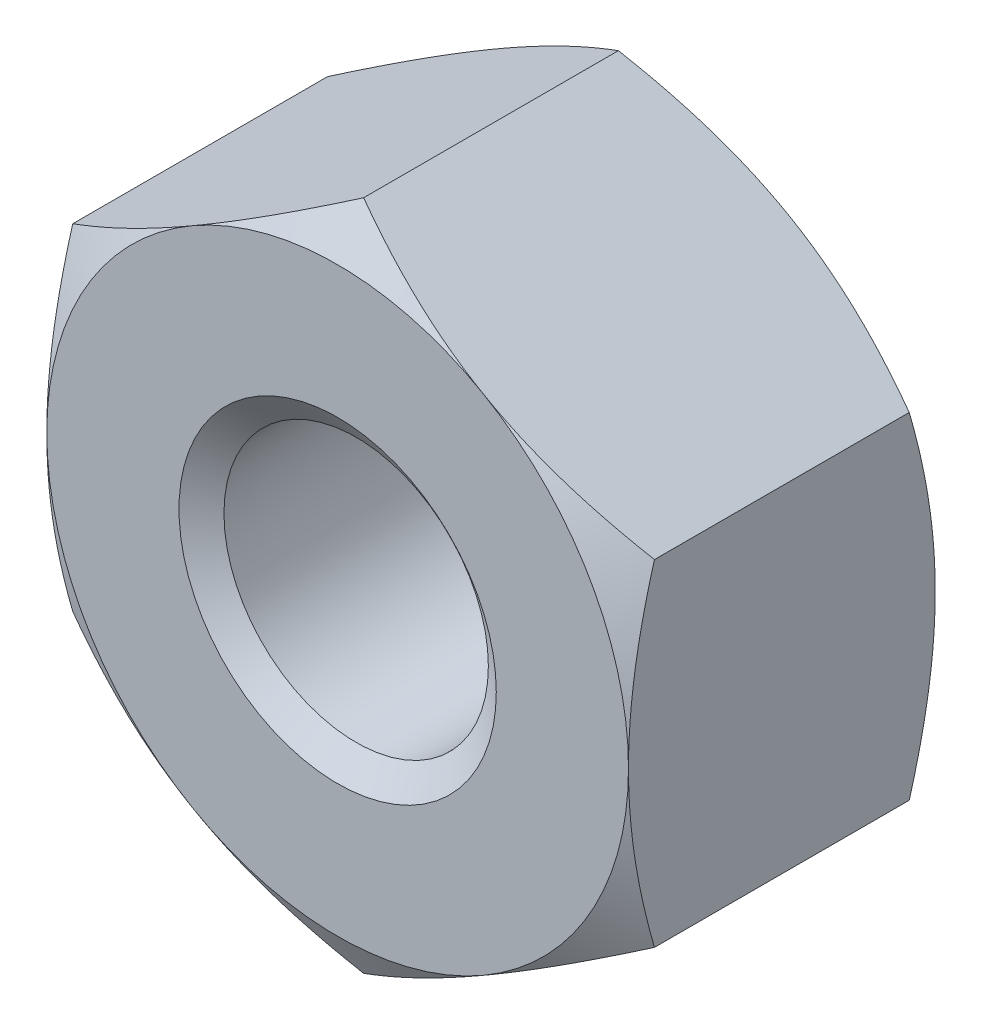
ISO-10303-21;
HEADER;
FILE_DESCRIPTION(('STEP AP214'),'2;1');
FILE_NAME('part.step','',(''),(''),'','','');
FILE_SCHEMA(('AUTOMOTIVE_DESIGN { 1 0 10303 214 1 1 1 1 }'));
ENDSEC;
DATA;
#1=APPLICATION_CONTEXT('core data for automotive mechanical design processes');
#2=APPLICATION_PROTOCOL_DEFINITION('international standard','automotive_design',2000,#1);
#3=PRODUCT_CONTEXT('',#1,'mechanical');
#4=PRODUCT('Part','Part','',(#3));
#5=PRODUCT_RELATED_PRODUCT_CATEGORY('part','',(#4));
#6=PRODUCT_DEFINITION_FORMATION('','',#4);
#7=PRODUCT_DEFINITION_CONTEXT('part definition',#1,'design');
#8=PRODUCT_DEFINITION('design','',#6,#7);
#9=PRODUCT_DEFINITION_SHAPE('','',#8);
#10=(LENGTH_UNIT() NAMED_UNIT(*) SI_UNIT(.MILLI.,.METRE.));
#11=(NAMED_UNIT(*) PLANE_ANGLE_UNIT() SI_UNIT($,.RADIAN.));
#12=(NAMED_UNIT(*) SI_UNIT($,.STERADIAN.) SOLID_ANGLE_UNIT());
#13=UNCERTAINTY_MEASURE_WITH_UNIT(LENGTH_MEASURE(1.E-05),#10,'distance_accuracy_value','');
#14=(GEOMETRIC_REPRESENTATION_CONTEXT(3) GLOBAL_UNCERTAINTY_ASSIGNED_CONTEXT((#13)) GLOBAL_UNIT_ASSIGNED_CONTEXT((#10,
#11,#12)) REPRESENTATION_CONTEXT('',''));
#15=CARTESIAN_POINT('',(0.,0.,0.));
#16=DIRECTION('',(0.,0.,1.));
#17=DIRECTION('',(1.,0.,0.));
#18=AXIS2_PLACEMENT_3D('',#15,#16,#17);
#19=CARTESIAN_POINT('',(0.,0.,-2.9));
#20=DIRECTION('',(0.,0.,1.));
#21=DIRECTION('',(1.,0.,0.));
#22=AXIS2_PLACEMENT_3D('',#19,#20,#21);
#23=CYLINDRICAL_SURFACE('',#22,1.25);
#24=CARTESIAN_POINT('',(0.,0.,-0.175051884552432));
#25=DIRECTION('',(0.,0.,1.));
#26=DIRECTION('',(1.,0.,0.));
#27=AXIS2_PLACEMENT_3D('',#24,#25,#26);
#28=CIRCLE('',#27,1.25);
#29=CARTESIAN_POINT('',(1.25,0.,-0.175051884552432));
#30=VERTEX_POINT('',#29);
#31=EDGE_CURVE('E175',#30,#30,#28,.F.);
#32=ORIENTED_EDGE('',*,*,#31,.F.);
#33=EDGE_LOOP('',(#32));
#34=FACE_BOUND('',#33,.T.);
#35=CARTESIAN_POINT('',(0.,0.,-2.69954811544756));
#36=DIRECTION('',(0.,0.,-1.));
#37=DIRECTION('',(-1.,0.,0.));
#38=AXIS2_PLACEMENT_3D('',#35,#36,#37);
#39=CIRCLE('',#38,1.25);
#40=CARTESIAN_POINT('',(-1.25,0.,-2.69954811544756));
#41=VERTEX_POINT('',#40);
#42=EDGE_CURVE('E40',#41,#41,#39,.F.);
#43=ORIENTED_EDGE('',*,*,#42,.F.);
#44=EDGE_LOOP('',(#43));
#45=FACE_BOUND('',#44,.T.);
#46=ADVANCED_FACE('F35',(#34,#45),#23,.F.);
#47=CARTESIAN_POINT('',(0.,3.17542648054296,-2.9));
#48=DIRECTION('',(0.,0.,-1.));
#49=DIRECTION('',(-1.,0.,0.));
#50=AXIS2_PLACEMENT_3D('',#47,#48,#49);
#51=PLANE('',#50);
#52=CARTESIAN_POINT('',(0.,0.,-2.9));
#53=DIRECTION('',(0.,0.,-1.));
#54=DIRECTION('',(-1.,0.,0.));
#55=AXIS2_PLACEMENT_3D('',#52,#53,#54);
#56=CIRCLE('',#55,2.75);
#57=CARTESIAN_POINT('',(-2.75,0.,-2.9));
#58=VERTEX_POINT('',#57);
#59=CARTESIAN_POINT('',(-1.37500000000002,-2.3815698604072,-2.9));
#60=VERTEX_POINT('',#59);
#61=EDGE_CURVE('E171',#58,#60,#56,.F.);
#62=ORIENTED_EDGE('',*,*,#61,.F.);
#63=CARTESIAN_POINT('',(-1.37500000000002,2.38156986040719,-2.9));
#64=VERTEX_POINT('',#63);
#65=EDGE_CURVE('E153',#64,#58,#56,.F.);
#66=ORIENTED_EDGE('',*,*,#65,.F.);
#67=CARTESIAN_POINT('',(1.37500000000002,2.38156986040719,-2.9));
#68=VERTEX_POINT('',#67);
#69=EDGE_CURVE('E170',#68,#64,#56,.F.);
#70=ORIENTED_EDGE('',*,*,#69,.F.);
#71=CARTESIAN_POINT('',(0.,0.,-2.9));
#72=DIRECTION('',(0.,0.,1.));
#73=DIRECTION('',(1.,0.,0.));
#74=AXIS2_PLACEMENT_3D('',#71,#72,#73);
#75=CIRCLE('',#74,2.75);
#76=CARTESIAN_POINT('',(2.75,0.,-2.9));
#77=VERTEX_POINT('',#76);
#78=EDGE_CURVE('E245',#77,#68,#75,.T.);
#79=ORIENTED_EDGE('',*,*,#78,.F.);
#80=CARTESIAN_POINT('',(1.37500000000002,-2.38156986040719,-2.9));
#81=VERTEX_POINT('',#80);
#82=EDGE_CURVE('E361',#81,#77,#56,.F.);
#83=ORIENTED_EDGE('',*,*,#82,.F.);
#84=EDGE_CURVE('E365',#60,#81,#56,.F.);
#85=ORIENTED_EDGE('',*,*,#84,.F.);
#86=EDGE_LOOP('',(#62,#66,#70,#79,#83,#85));
#87=FACE_BOUND('',#86,.T.);
#88=CARTESIAN_POINT('',(0.,0.,-2.9));
#89=DIRECTION('',(0.,0.,-1.));
#90=DIRECTION('',(-1.,0.,0.));
#91=AXIS2_PLACEMENT_3D('',#88,#89,#90);
#92=CIRCLE('',#91,1.5);
#93=CARTESIAN_POINT('',(-1.5,0.,-2.9));
#94=VERTEX_POINT('',#93);
#95=EDGE_CURVE('E178',#94,#94,#92,.F.);
#96=ORIENTED_EDGE('',*,*,#95,.T.);
#97=EDGE_LOOP('',(#96));
#98=FACE_BOUND('',#97,.T.);
#99=ADVANCED_FACE('F298',(#87,#98),#51,.T.);
#100=CARTESIAN_POINT('',(0.,3.17542648054296,0.));
#101=DIRECTION('',(0.,0.,-1.));
#102=DIRECTION('',(-1.,0.,0.));
#103=AXIS2_PLACEMENT_3D('',#100,#101,#102);
#104=PLANE('',#103);
#105=CARTESIAN_POINT('',(0.,0.,0.));
#106=DIRECTION('',(0.,0.,-1.));
#107=DIRECTION('',(-1.,0.,0.));
#108=AXIS2_PLACEMENT_3D('',#105,#106,#107);
#109=CIRCLE('',#108,2.75);
#110=CARTESIAN_POINT('',(-2.75,0.,0.));
#111=VERTEX_POINT('',#110);
#112=CARTESIAN_POINT('',(-1.37500000000002,2.38156986040719,0.));
#113=VERTEX_POINT('',#112);
#114=EDGE_CURVE('E11',#111,#113,#109,.T.);
#115=ORIENTED_EDGE('',*,*,#114,.F.);
#116=CARTESIAN_POINT('',(-1.37500000000002,-2.3815698604072,0.));
#117=VERTEX_POINT('',#116);
#118=EDGE_CURVE('E47',#117,#111,#109,.T.);
#119=ORIENTED_EDGE('',*,*,#118,.F.);
#120=CARTESIAN_POINT('',(1.37500000000002,-2.38156986040719,0.));
#121=VERTEX_POINT('',#120);
#122=EDGE_CURVE('E174',#121,#117,#109,.T.);
#123=ORIENTED_EDGE('',*,*,#122,.F.);
#124=CARTESIAN_POINT('',(2.75,0.,0.));
#125=VERTEX_POINT('',#124);
#126=EDGE_CURVE('E352',#125,#121,#109,.T.);
#127=ORIENTED_EDGE('',*,*,#126,.F.);
#128=CARTESIAN_POINT('',(0.,0.,0.));
#129=DIRECTION('',(0.,0.,1.));
#130=DIRECTION('',(1.,0.,0.));
#131=AXIS2_PLACEMENT_3D('',#128,#129,#130);
#132=CIRCLE('',#131,2.75);
#133=CARTESIAN_POINT('',(1.37500000000002,2.38156986040719,0.));
#134=VERTEX_POINT('',#133);
#135=EDGE_CURVE('E129',#125,#134,#132,.T.);
#136=ORIENTED_EDGE('',*,*,#135,.T.);
#137=EDGE_CURVE('E45',#113,#134,#109,.T.);
#138=ORIENTED_EDGE('',*,*,#137,.F.);
#139=EDGE_LOOP('',(#115,#119,#123,#127,#136,#138));
#140=FACE_BOUND('',#139,.T.);
#141=CARTESIAN_POINT('',(0.,0.,0.));
#142=DIRECTION('',(0.,0.,1.));
#143=DIRECTION('',(1.,0.,0.));
#144=AXIS2_PLACEMENT_3D('',#141,#142,#143);
#145=CIRCLE('',#144,1.5);
#146=CARTESIAN_POINT('',(1.5,0.,0.));
#147=VERTEX_POINT('',#146);
#148=EDGE_CURVE('E177',#147,#147,#145,.T.);
#149=ORIENTED_EDGE('',*,*,#148,.F.);
#150=EDGE_LOOP('',(#149));
#151=FACE_BOUND('',#150,.T.);
#152=ADVANCED_FACE('F250',(#140,#151),#104,.F.);
#153=CARTESIAN_POINT('',(0.,3.17542648054296,-2.9));
#154=DIRECTION('',(-0.500000000000008,0.866025403784434,0.));
#155=DIRECTION('',(-0.866025403784434,-0.500000000000008,0.));
#156=AXIS2_PLACEMENT_3D('',#153,#154,#155);
#157=PLANE('',#156);
#158=DIRECTION('',(0.,0.,1.));
#159=VECTOR('',#158,1.);
#160=CARTESIAN_POINT('',(-2.75,1.58771324027145,-2.9));
#161=LINE('',#160,#159);
#162=CARTESIAN_POINT('',(-2.75,1.58771324027151,-2.65437990693812));
#163=VERTEX_POINT('',#162);
#164=CARTESIAN_POINT('',(-2.75,1.58771324027145,-0.24562009306186));
#165=VERTEX_POINT('',#164);
#166=EDGE_CURVE('E165',#163,#165,#161,.T.);
#167=ORIENTED_EDGE('',*,*,#166,.T.);
#168=CARTESIAN_POINT('',(-2.7502,1.58759777021761,-0.245686763364759));
#169=CARTESIAN_POINT('',(-2.62935077934009,1.65737010029697,-0.205387662249261));
#170=CARTESIAN_POINT('',(-2.50745839737737,1.72774469983531,-0.16873690259766));
#171=CARTESIAN_POINT('',(-2.26156287327211,1.86971254687001,-0.104762182969798));
#172=CARTESIAN_POINT('',(-2.13755536142615,1.94130831721582,-0.0774608556744948));
#173=CARTESIAN_POINT('',(-1.89107720202406,2.08361254889598,-0.0349617452941144));
#174=CARTESIAN_POINT('',(-1.76864448141259,2.15429911309863,-0.0194811186224555));
#175=CARTESIAN_POINT('',(-1.52320285763109,2.29600490065922,-0.000999397369938858));
#176=CARTESIAN_POINT('',(-1.4001948467671,2.36702360884403,0.00201700053740133));
#177=CARTESIAN_POINT('',(-1.17034121338921,2.49972966594897,-0.00425314542854674));
#178=CARTESIAN_POINT('',(-1.06346120874598,2.56143686540072,-0.0120001542767031));
#179=CARTESIAN_POINT('',(-0.850397532665255,2.68444923614047,-0.0365551810643573));
#180=CARTESIAN_POINT('',(-0.744214598351115,2.74575398185008,-0.0533715896505739));
#181=CARTESIAN_POINT('',(-0.530711510606819,2.86902004703207,-0.0954119223459625));
#182=CARTESIAN_POINT('',(-0.423418383857147,2.93096576264319,-0.120814080687238));
#183=CARTESIAN_POINT('',(-0.210432520715949,3.05393320806135,-0.178467225839992));
#184=CARTESIAN_POINT('',(-0.104737054973347,3.11495651365997,-0.210704663298995));
#185=CARTESIAN_POINT('',(0.000200000000001484,3.1755419505968,-0.245686763364774));
#186=B_SPLINE_CURVE_WITH_KNOTS('',3,(#168,#169,#170,#171,#172,#173,#174,#175,#176,#177,#178,
#179,#180,#181,#182,#183,#184,#185),.UNSPECIFIED.,.F.,.F.,(4,2,2,2,2,2,2,2,4),(0.,
0.435912828725888,0.872873557116333,1.29901931904672,1.72464171213574,2.09526089052938,
2.46622354066375,2.84541551798559,3.22386274754526),.UNSPECIFIED.);
#187=EDGE_CURVE('E134',#165,#113,#186,.T.);
#188=ORIENTED_EDGE('',*,*,#187,.T.);
#189=CARTESIAN_POINT('',(0.,3.17542648054296,-0.245620093061876));
#190=VERTEX_POINT('',#189);
#191=EDGE_CURVE('E54',#113,#190,#186,.T.);
#192=ORIENTED_EDGE('',*,*,#191,.T.);
#193=DIRECTION('',(0.,0.,1.));
#194=VECTOR('',#193,1.);
#195=CARTESIAN_POINT('',(0.,3.17542648054296,-2.9));
#196=LINE('',#195,#194);
#197=CARTESIAN_POINT('',(0.,3.17542648054296,-2.65437990693812));
#198=VERTEX_POINT('',#197);
#199=EDGE_CURVE('E150',#198,#190,#196,.T.);
#200=ORIENTED_EDGE('',*,*,#199,.F.);
#201=CARTESIAN_POINT('',(-2.7502,1.58759777021761,-2.65431323663524));
#202=CARTESIAN_POINT('',(-2.62935077934009,1.65737010029697,-2.69461233775074));
#203=CARTESIAN_POINT('',(-2.50745839737737,1.72774469983531,-2.73126309740234));
#204=CARTESIAN_POINT('',(-2.26156287327211,1.86971254687001,-2.7952378170302));
#205=CARTESIAN_POINT('',(-2.13755536142615,1.94130831721582,-2.8225391443255));
#206=CARTESIAN_POINT('',(-1.89107720202406,2.08361254889598,-2.86503825470589));
#207=CARTESIAN_POINT('',(-1.76864448141259,2.15429911309863,-2.88051888137754));
#208=CARTESIAN_POINT('',(-1.52320285763109,2.29600490065922,-2.89900060263006));
#209=CARTESIAN_POINT('',(-1.4001948467671,2.36702360884403,-2.9020170005374));
#210=CARTESIAN_POINT('',(-1.17034121338921,2.49972966594897,-2.89574685457145));
#211=CARTESIAN_POINT('',(-1.06346120874598,2.56143686540072,-2.8879998457233));
#212=CARTESIAN_POINT('',(-0.850397532665255,2.68444923614047,-2.86344481893564));
#213=CARTESIAN_POINT('',(-0.744214598351115,2.74575398185008,-2.84662841034943));
#214=CARTESIAN_POINT('',(-0.530711510606819,2.86902004703207,-2.80458807765404));
#215=CARTESIAN_POINT('',(-0.423418383857147,2.93096576264319,-2.77918591931276));
#216=CARTESIAN_POINT('',(-0.210432520715949,3.05393320806135,-2.72153277416001));
#217=CARTESIAN_POINT('',(-0.104737054973347,3.11495651365997,-2.68929533670101));
#218=CARTESIAN_POINT('',(0.000200000000001484,3.1755419505968,-2.65431323663523));
#219=B_SPLINE_CURVE_WITH_KNOTS('',3,(#201,#202,#203,#204,#205,#206,#207,#208,#209,#210,#211,
#212,#213,#214,#215,#216,#217,#218),.UNSPECIFIED.,.F.,.F.,(4,2,2,2,2,2,2,2,4),(0.,
0.435912828725888,0.872873557116333,1.29901931904672,1.72464171213574,2.09526089052938,
2.46622354066375,2.84541551798559,3.22386274754526),.UNSPECIFIED.);
#220=EDGE_CURVE('E168',#64,#198,#219,.T.);
#221=ORIENTED_EDGE('',*,*,#220,.F.);
#222=EDGE_CURVE('E260',#163,#64,#219,.T.);
#223=ORIENTED_EDGE('',*,*,#222,.F.);
#224=EDGE_LOOP('',(#167,#188,#192,#200,#221,#223));
#225=FACE_BOUND('',#224,.T.);
#226=ADVANCED_FACE('F37',(#225),#157,.T.);
#227=CARTESIAN_POINT('',(2.75,1.58771324027146,-2.9));
#228=DIRECTION('',(0.500000000000008,0.866025403784434,0.));
#229=DIRECTION('',(-0.866025403784434,0.500000000000008,0.));
#230=AXIS2_PLACEMENT_3D('',#227,#228,#229);
#231=PLANE('',#230);
#232=ORIENTED_EDGE('',*,*,#199,.T.);
#233=CARTESIAN_POINT('',(-0.00019999999999841,3.1755419505968,-0.245686763364774));
#234=CARTESIAN_POINT('',(0.120649220659907,3.10576962051744,-0.205387662249276));
#235=CARTESIAN_POINT('',(0.242541602622635,3.03539502097909,-0.168736902597673));
#236=CARTESIAN_POINT('',(0.488437126727895,2.8934271739444,-0.104762182969809));
#237=CARTESIAN_POINT('',(0.612444638573858,2.82183140359859,-0.0774608556745041));
#238=CARTESIAN_POINT('',(0.858922797975947,2.67952717191843,-0.0349617452941211));
#239=CARTESIAN_POINT('',(0.98135551858742,2.60884060771578,-0.0194811186224611));
#240=CARTESIAN_POINT('',(1.22679714236892,2.46713482015519,-0.000999397369942027));
#241=CARTESIAN_POINT('',(1.34980515323292,2.39611611197038,0.0020170005373994));
#242=CARTESIAN_POINT('',(1.5796587866108,2.26341005486544,-0.00425314542854663));
#243=CARTESIAN_POINT('',(1.68653879125402,2.20170285541368,-0.0120001542767019));
#244=CARTESIAN_POINT('',(1.89960246733475,2.07869048467394,-0.0365551810643538));
#245=CARTESIAN_POINT('',(2.00578540164889,2.01738573896433,-0.0533715896505692));
#246=CARTESIAN_POINT('',(2.21928848939318,1.89411967378234,-0.0954119223459551));
#247=CARTESIAN_POINT('',(2.32658161614286,1.83217395817122,-0.12081408068723));
#248=CARTESIAN_POINT('',(2.53956747928405,1.70920651275306,-0.178467225839981));
#249=CARTESIAN_POINT('',(2.64526294502665,1.64818320715445,-0.210704663298982));
#250=CARTESIAN_POINT('',(2.7502,1.58759777021762,-0.24568676336476));
#251=B_SPLINE_CURVE_WITH_KNOTS('',3,(#233,#234,#235,#236,#237,#238,#239,#240,#241,#242,#243,
#244,#245,#246,#247,#248,#249,#250),.UNSPECIFIED.,.F.,.F.,(4,2,2,2,2,2,2,2,4),(0.,
0.435912828725892,0.872873557116339,1.29901931904673,1.72464171213575,2.09526089052939,
2.46622354066376,2.84541551798559,3.22386274754526),.UNSPECIFIED.);
#252=EDGE_CURVE('E144',#190,#134,#251,.T.);
#253=ORIENTED_EDGE('',*,*,#252,.T.);
#254=CARTESIAN_POINT('',(2.75,1.58771324027151,-0.245620093061876));
#255=VERTEX_POINT('',#254);
#256=EDGE_CURVE('E61',#134,#255,#251,.T.);
#257=ORIENTED_EDGE('',*,*,#256,.T.);
#258=DIRECTION('',(0.,0.,1.));
#259=VECTOR('',#258,1.);
#260=CARTESIAN_POINT('',(2.75,1.58771324027146,-2.9));
#261=LINE('',#260,#259);
#262=CARTESIAN_POINT('',(2.75,1.58771324027151,-2.65437990693812));
#263=VERTEX_POINT('',#262);
#264=EDGE_CURVE('E143',#263,#255,#261,.T.);
#265=ORIENTED_EDGE('',*,*,#264,.F.);
#266=CARTESIAN_POINT('',(-0.00019999999999841,3.1755419505968,-2.65431323663523));
#267=CARTESIAN_POINT('',(0.120649220659908,3.10576962051744,-2.69461233775072));
#268=CARTESIAN_POINT('',(0.242541602622636,3.03539502097909,-2.73126309740233));
#269=CARTESIAN_POINT('',(0.488437126727895,2.8934271739444,-2.79523781703019));
#270=CARTESIAN_POINT('',(0.612444638573858,2.82183140359859,-2.8225391443255));
#271=CARTESIAN_POINT('',(0.858922797975947,2.67952717191843,-2.86503825470588));
#272=CARTESIAN_POINT('',(0.98135551858742,2.60884060771578,-2.88051888137754));
#273=CARTESIAN_POINT('',(1.22679714236892,2.46713482015519,-2.89900060263006));
#274=CARTESIAN_POINT('',(1.34980515323292,2.39611611197038,-2.9020170005374));
#275=CARTESIAN_POINT('',(1.5796587866108,2.26341005486544,-2.89574685457145));
#276=CARTESIAN_POINT('',(1.68653879125402,2.20170285541368,-2.8879998457233));
#277=CARTESIAN_POINT('',(1.89960246733475,2.07869048467394,-2.86344481893565));
#278=CARTESIAN_POINT('',(2.00578540164889,2.01738573896433,-2.84662841034943));
#279=CARTESIAN_POINT('',(2.21928848939318,1.89411967378234,-2.80458807765404));
#280=CARTESIAN_POINT('',(2.32658161614286,1.83217395817122,-2.77918591931277));
#281=CARTESIAN_POINT('',(2.53956747928405,1.70920651275306,-2.72153277416002));
#282=CARTESIAN_POINT('',(2.64526294502665,1.64818320715445,-2.68929533670102));
#283=CARTESIAN_POINT('',(2.7502,1.58759777021762,-2.65431323663524));
#284=B_SPLINE_CURVE_WITH_KNOTS('',3,(#266,#267,#268,#269,#270,#271,#272,#273,#274,#275,#276,
#277,#278,#279,#280,#281,#282,#283),.UNSPECIFIED.,.F.,.F.,(4,2,2,2,2,2,2,2,4),(0.,
0.435912828725892,0.87287355711634,1.29901931904673,1.72464171213575,2.09526089052939,
2.46622354066376,2.84541551798559,3.22386274754526),.UNSPECIFIED.);
#285=EDGE_CURVE('E254',#68,#263,#284,.T.);
#286=ORIENTED_EDGE('',*,*,#285,.F.);
#287=EDGE_CURVE('E259',#198,#68,#284,.T.);
#288=ORIENTED_EDGE('',*,*,#287,.F.);
#289=EDGE_LOOP('',(#232,#253,#257,#265,#286,#288));
#290=FACE_BOUND('',#289,.T.);
#291=ADVANCED_FACE('F141',(#290),#231,.T.);
#292=CARTESIAN_POINT('',(2.75,1.58771324027146,-2.9));
#293=DIRECTION('',(-1.,0.,0.));
#294=DIRECTION('',(0.,0.,1.));
#295=AXIS2_PLACEMENT_3D('',#292,#293,#294);
#296=PLANE('',#295);
#297=CARTESIAN_POINT('',(2.75,-4.21084949309679,-1.31594843960297));
#298=CARTESIAN_POINT('',(2.75,-4.09010894214093,-1.25759993615227));
#299=CARTESIAN_POINT('',(2.75,-3.96908292065512,-1.19983146511761));
#300=CARTESIAN_POINT('',(2.75,-3.72630558284847,-1.08578603842308));
#301=CARTESIAN_POINT('',(2.75,-3.60455414536203,-1.0295093410025));
#302=CARTESIAN_POINT('',(2.75,-3.35951393034357,-0.918482443352782));
#303=CARTESIAN_POINT('',(2.75,-3.23622034236439,-0.863742821605862));
#304=CARTESIAN_POINT('',(2.75,-2.98861980138746,-0.756614777476476));
#305=CARTESIAN_POINT('',(2.75,-2.86431290161185,-0.704226232536785));
#306=CARTESIAN_POINT('',(2.75,-2.61294485887175,-0.601803572146143));
#307=CARTESIAN_POINT('',(2.75,-2.48586863815657,-0.551806257898411));
#308=CARTESIAN_POINT('',(2.75,-2.23021732171543,-0.455727408784617));
#309=CARTESIAN_POINT('',(2.75,-2.10164206103366,-0.409646309576986));
#310=CARTESIAN_POINT('',(2.75,-1.8430521879947,-0.322638077046243));
#311=CARTESIAN_POINT('',(2.75,-1.71304130052586,-0.281699986413899));
#312=CARTESIAN_POINT('',(2.75,-1.4511712506215,-0.206307307624357));
#313=CARTESIAN_POINT('',(2.75,-1.31931268690205,-0.171850669152775));
#314=CARTESIAN_POINT('',(2.75,-1.05365722480015,-0.11109367153091));
#315=CARTESIAN_POINT('',(2.75,-0.919859820217613,-0.0847954840951266));
#316=CARTESIAN_POINT('',(2.75,-0.650651874037402,-0.0421260371966145));
#317=CARTESIAN_POINT('',(2.75,-0.515241331013615,-0.0257547865105455));
#318=CARTESIAN_POINT('',(2.75,-0.24437324286923,-0.00438749654023847));
#319=CARTESIAN_POINT('',(2.75,-0.108921526377152,0.00068055677321543));
#320=CARTESIAN_POINT('',(2.75,0.161887058855117,-0.000827795632671484));
#321=CARTESIAN_POINT('',(2.75,0.297243943089624,-0.00740117868555267));
#322=CARTESIAN_POINT('',(2.75,0.528385436717524,-0.0281041300468421));
#323=CARTESIAN_POINT('',(2.75,0.62442505013748,-0.039537641030186));
#324=CARTESIAN_POINT('',(2.75,0.815762399811519,-0.0675217196133478));
#325=CARTESIAN_POINT('',(2.75,0.911060016631939,-0.0840730942276785));
#326=CARTESIAN_POINT('',(2.75,1.19576218748913,-0.140535361278279));
#327=CARTESIAN_POINT('',(2.75,1.38383224738493,-0.187239859417287));
#328=CARTESIAN_POINT('',(2.75,1.66525048947481,-0.267792497030569));
#329=CARTESIAN_POINT('',(2.75,1.76006556248553,-0.296803334995491));
#330=CARTESIAN_POINT('',(2.75,1.9487060938221,-0.357695648906576));
#331=CARTESIAN_POINT('',(2.75,2.04253218553691,-0.389575144878491));
#332=CARTESIAN_POINT('',(2.75,2.22880240354979,-0.455541418186434));
#333=CARTESIAN_POINT('',(2.75,2.32125133588446,-0.489614761455518));
#334=CARTESIAN_POINT('',(2.75,2.50543192042622,-0.559761368231093));
#335=CARTESIAN_POINT('',(2.75,2.59716326539573,-0.5958354400373));
#336=CARTESIAN_POINT('',(2.75,2.68856293053339,-0.632712441997466));
#337=B_SPLINE_CURVE_WITH_KNOTS('',3,(#297,#298,#299,#300,#301,#302,#303,#304,#305,#306,#307,
#308,#309,#310,#311,#312,#313,#314,#315,#316,#317,#318,#319,#320,#321,#322,#323,#324,#325,#326,
#327,#328,#329,#330,#331,#332,#333,#334,#335,#336),.UNSPECIFIED.,.F.,.F.,(4,2,2,2,2,2,2,2,2,2,2,
2,2,2,2,2,2,2,2,4),(0.,0.402305607365937,0.804680408536999,1.20935783819118,1.61401414820819,
2.02363838185771,2.4333081245735,2.84208969479601,3.25074173456638,3.65950246109145,
4.06826354901185,4.47441284024652,4.88045669141174,5.17046846817547,5.46052599902453,
6.04107275309882,6.3385113130466,6.63574613017453,6.9313079100579,7.22698998004819),.UNSPECIFIED.);
#338=CARTESIAN_POINT('',(2.75000000000001,-1.58771324027149,-0.245620093061876));
#339=VERTEX_POINT('',#338);
#340=EDGE_CURVE('E136',#339,#125,#337,.T.);
#341=ORIENTED_EDGE('',*,*,#340,.F.);
#342=DIRECTION('',(0.,0.,1.));
#343=VECTOR('',#342,1.);
#344=CARTESIAN_POINT('',(2.75,-1.5877132402715,-2.9));
#345=LINE('',#344,#343);
#346=CARTESIAN_POINT('',(2.75000000000001,-1.58771324027149,-2.65437990693812));
#347=VERTEX_POINT('',#346);
#348=EDGE_CURVE('E151',#347,#339,#345,.T.);
#349=ORIENTED_EDGE('',*,*,#348,.F.);
#350=CARTESIAN_POINT('',(2.75,-4.21084949309679,-1.58405156039703));
#351=CARTESIAN_POINT('',(2.75,-4.09010894214093,-1.64240006384773));
#352=CARTESIAN_POINT('',(2.75,-3.96908292065512,-1.70016853488238));
#353=CARTESIAN_POINT('',(2.75,-3.72630558284847,-1.81421396157692));
#354=CARTESIAN_POINT('',(2.75,-3.60455414536203,-1.8704906589975));
#355=CARTESIAN_POINT('',(2.75,-3.35951393034357,-1.98151755664722));
#356=CARTESIAN_POINT('',(2.75,-3.23622034236439,-2.03625717839414));
#357=CARTESIAN_POINT('',(2.75,-2.98861980138746,-2.14338522252352));
#358=CARTESIAN_POINT('',(2.75,-2.86431290161185,-2.19577376746322));
#359=CARTESIAN_POINT('',(2.75,-2.61294485887175,-2.29819642785386));
#360=CARTESIAN_POINT('',(2.75,-2.48586863815657,-2.34819374210159));
#361=CARTESIAN_POINT('',(2.75,-2.23021732171543,-2.44427259121538));
#362=CARTESIAN_POINT('',(2.75,-2.10164206103366,-2.49035369042301));
#363=CARTESIAN_POINT('',(2.75,-1.8430521879947,-2.57736192295376));
#364=CARTESIAN_POINT('',(2.75,-1.71304130052586,-2.6183000135861));
#365=CARTESIAN_POINT('',(2.75,-1.4511712506215,-2.69369269237564));
#366=CARTESIAN_POINT('',(2.75,-1.31931268690205,-2.72814933084722));
#367=CARTESIAN_POINT('',(2.75,-1.05365722480015,-2.78890632846909));
#368=CARTESIAN_POINT('',(2.75,-0.919859820217613,-2.81520451590487));
#369=CARTESIAN_POINT('',(2.75,-0.650651874037402,-2.85787396280339));
#370=CARTESIAN_POINT('',(2.75,-0.515241331013615,-2.87424521348945));
#371=CARTESIAN_POINT('',(2.75,-0.24437324286923,-2.89561250345976));
#372=CARTESIAN_POINT('',(2.75,-0.108921526377152,-2.90068055677322));
#373=CARTESIAN_POINT('',(2.75,0.161887058855117,-2.89917220436733));
#374=CARTESIAN_POINT('',(2.75,0.297243943089624,-2.89259882131445));
#375=CARTESIAN_POINT('',(2.75,0.528385436717524,-2.87189586995316));
#376=CARTESIAN_POINT('',(2.75,0.624425050137481,-2.86046235896981));
#377=CARTESIAN_POINT('',(2.75,0.815762399811519,-2.83247828038665));
#378=CARTESIAN_POINT('',(2.75,0.91106001663194,-2.81592690577232));
#379=CARTESIAN_POINT('',(2.75,1.19576218748913,-2.75946463872172));
#380=CARTESIAN_POINT('',(2.75,1.38383224738493,-2.71276014058271));
#381=CARTESIAN_POINT('',(2.75,1.66525048947481,-2.63220750296943));
#382=CARTESIAN_POINT('',(2.75,1.76006556248553,-2.60319666500451));
#383=CARTESIAN_POINT('',(2.75,1.9487060938221,-2.54230435109342));
#384=CARTESIAN_POINT('',(2.75,2.04253218553691,-2.51042485512151));
#385=CARTESIAN_POINT('',(2.75,2.22880240354979,-2.44445858181357));
#386=CARTESIAN_POINT('',(2.75,2.32125133588446,-2.41038523854448));
#387=CARTESIAN_POINT('',(2.75,2.50543192042623,-2.34023863176891));
#388=CARTESIAN_POINT('',(2.75,2.59716326539573,-2.3041645599627));
#389=CARTESIAN_POINT('',(2.75,2.68856293053339,-2.26728755800253));
#390=B_SPLINE_CURVE_WITH_KNOTS('',3,(#350,#351,#352,#353,#354,#355,#356,#357,#358,#359,#360,
#361,#362,#363,#364,#365,#366,#367,#368,#369,#370,#371,#372,#373,#374,#375,#376,#377,#378,#379,
#380,#381,#382,#383,#384,#385,#386,#387,#388,#389),.UNSPECIFIED.,.F.,.F.,(4,2,2,2,2,2,2,2,2,2,2,
2,2,2,2,2,2,2,2,4),(0.,0.402305607365937,0.804680408536999,1.20935783819118,1.61401414820819,
2.02363838185771,2.4333081245735,2.84208969479601,3.25074173456638,3.65950246109145,
4.06826354901185,4.47441284024652,4.88045669141174,5.17046846817547,5.46052599902453,
6.04107275309882,6.3385113130466,6.63574613017453,6.9313079100579,7.2269899800482),.UNSPECIFIED.);
#391=EDGE_CURVE('E266',#347,#77,#390,.T.);
#392=ORIENTED_EDGE('',*,*,#391,.T.);
#393=EDGE_CURVE('E149',#77,#263,#390,.T.);
#394=ORIENTED_EDGE('',*,*,#393,.T.);
#395=ORIENTED_EDGE('',*,*,#264,.T.);
#396=EDGE_CURVE('E126',#125,#255,#337,.T.);
#397=ORIENTED_EDGE('',*,*,#396,.F.);
#398=EDGE_LOOP('',(#341,#349,#392,#394,#395,#397));
#399=FACE_BOUND('',#398,.T.);
#400=ADVANCED_FACE('F147',(#399),#296,.F.);
#401=CARTESIAN_POINT('',(0.,-3.175426480543,-2.9));
#402=DIRECTION('',(0.500000000000007,-0.866025403784435,0.));
#403=DIRECTION('',(0.866025403784435,0.500000000000007,0.));
#404=AXIS2_PLACEMENT_3D('',#401,#402,#403);
#405=PLANE('',#404);
#406=ORIENTED_EDGE('',*,*,#348,.T.);
#407=CARTESIAN_POINT('',(2.7502,-1.58759777021766,-0.245686763364772));
#408=CARTESIAN_POINT('',(2.62935077934009,-1.65737010029702,-0.205387662249275));
#409=CARTESIAN_POINT('',(2.50745839737736,-1.72774469983536,-0.168736902597674));
#410=CARTESIAN_POINT('',(2.2615628732721,-1.86971254687006,-0.104762182969814));
#411=CARTESIAN_POINT('',(2.13755536142614,-1.94130831721586,-0.0774608556745108));
#412=CARTESIAN_POINT('',(1.89107720202405,-2.08361254889603,-0.034961745294132));
#413=CARTESIAN_POINT('',(1.76864448141258,-2.15429911309868,-0.0194811186224742));
#414=CARTESIAN_POINT('',(1.52320285763108,-2.29600490065927,-0.000999397369959439));
#415=CARTESIAN_POINT('',(1.40019484676708,-2.36702360884408,0.00201700053737997));
#416=CARTESIAN_POINT('',(1.1703412133892,-2.49972966594902,-0.00425314542856976));
#417=CARTESIAN_POINT('',(1.06346120874597,-2.56143686540077,-0.0120001542767267));
#418=CARTESIAN_POINT('',(0.850397532665246,-2.68444923614051,-0.0365551810643817));
#419=CARTESIAN_POINT('',(0.744214598351107,-2.74575398185013,-0.0533715896505985));
#420=CARTESIAN_POINT('',(0.530711510606813,-2.86902004703211,-0.095411922345987));
#421=CARTESIAN_POINT('',(0.423418383857143,-2.93096576264323,-0.120814080687263));
#422=CARTESIAN_POINT('',(0.210432520715948,-3.05393320806139,-0.178467225840016));
#423=CARTESIAN_POINT('',(0.104737054973347,-3.11495651366001,-0.210704663299018));
#424=CARTESIAN_POINT('',(-0.000199999999999593,-3.17554195059683,-0.245686763364796));
#425=B_SPLINE_CURVE_WITH_KNOTS('',3,(#407,#408,#409,#410,#411,#412,#413,#414,#415,#416,#417,
#418,#419,#420,#421,#422,#423,#424),.UNSPECIFIED.,.F.,.F.,(4,2,2,2,2,2,2,2,4),(0.,
0.435912828725892,0.872873557116339,1.29901931904673,1.72464171213575,2.09526089052939,
2.46622354066376,2.84541551798559,3.22386274754526),.UNSPECIFIED.);
#426=EDGE_CURVE('E347',#339,#121,#425,.T.);
#427=ORIENTED_EDGE('',*,*,#426,.T.);
#428=CARTESIAN_POINT('',(0.,-3.17542648054296,-0.245620093061876));
#429=VERTEX_POINT('',#428);
#430=EDGE_CURVE('E226',#121,#429,#425,.T.);
#431=ORIENTED_EDGE('',*,*,#430,.T.);
#432=DIRECTION('',(0.,0.,1.));
#433=VECTOR('',#432,1.);
#434=CARTESIAN_POINT('',(0.,-3.175426480543,-2.9));
#435=LINE('',#434,#433);
#436=CARTESIAN_POINT('',(0.,-3.17542648054296,-2.65437990693812));
#437=VERTEX_POINT('',#436);
#438=EDGE_CURVE('E156',#437,#429,#435,.T.);
#439=ORIENTED_EDGE('',*,*,#438,.F.);
#440=CARTESIAN_POINT('',(2.7502,-1.58759777021766,-2.65431323663523));
#441=CARTESIAN_POINT('',(2.62935077934009,-1.65737010029702,-2.69461233775072));
#442=CARTESIAN_POINT('',(2.50745839737736,-1.72774469983536,-2.73126309740233));
#443=CARTESIAN_POINT('',(2.2615628732721,-1.86971254687006,-2.79523781703019));
#444=CARTESIAN_POINT('',(2.13755536142614,-1.94130831721586,-2.82253914432549));
#445=CARTESIAN_POINT('',(1.89107720202405,-2.08361254889603,-2.86503825470587));
#446=CARTESIAN_POINT('',(1.76864448141258,-2.15429911309868,-2.88051888137753));
#447=CARTESIAN_POINT('',(1.52320285763108,-2.29600490065927,-2.89900060263004));
#448=CARTESIAN_POINT('',(1.40019484676708,-2.36702360884408,-2.90201700053738));
#449=CARTESIAN_POINT('',(1.1703412133892,-2.49972966594902,-2.89574685457143));
#450=CARTESIAN_POINT('',(1.06346120874597,-2.56143686540077,-2.88799984572327));
#451=CARTESIAN_POINT('',(0.850397532665246,-2.68444923614051,-2.86344481893562));
#452=CARTESIAN_POINT('',(0.744214598351107,-2.74575398185013,-2.8466284103494));
#453=CARTESIAN_POINT('',(0.530711510606814,-2.86902004703211,-2.80458807765401));
#454=CARTESIAN_POINT('',(0.423418383857143,-2.93096576264323,-2.77918591931274));
#455=CARTESIAN_POINT('',(0.210432520715948,-3.05393320806139,-2.72153277415998));
#456=CARTESIAN_POINT('',(0.104737054973347,-3.11495651366001,-2.68929533670098));
#457=CARTESIAN_POINT('',(-0.000199999999999591,-3.17554195059683,-2.6543132366352));
#458=B_SPLINE_CURVE_WITH_KNOTS('',3,(#440,#441,#442,#443,#444,#445,#446,#447,#448,#449,#450,
#451,#452,#453,#454,#455,#456,#457),.UNSPECIFIED.,.F.,.F.,(4,2,2,2,2,2,2,2,4),(0.,
0.435912828725892,0.872873557116339,1.29901931904673,1.72464171213575,2.09526089052939,
2.46622354066376,2.84541551798559,3.22386274754526),.UNSPECIFIED.);
#459=EDGE_CURVE('E272',#81,#437,#458,.T.);
#460=ORIENTED_EDGE('',*,*,#459,.F.);
#461=EDGE_CURVE('E271',#347,#81,#458,.T.);
#462=ORIENTED_EDGE('',*,*,#461,.F.);
#463=EDGE_LOOP('',(#406,#427,#431,#439,#460,#462));
#464=FACE_BOUND('',#463,.T.);
#465=ADVANCED_FACE('F282',(#464),#405,.T.);
#466=CARTESIAN_POINT('',(-2.75,-1.5877132402715,-2.9));
#467=DIRECTION('',(-0.500000000000006,-0.866025403784435,0.));
#468=DIRECTION('',(0.866025403784435,-0.500000000000006,0.));
#469=AXIS2_PLACEMENT_3D('',#466,#467,#468);
#470=PLANE('',#469);
#471=ORIENTED_EDGE('',*,*,#438,.T.);
#472=CARTESIAN_POINT('',(0.000200000000001002,-3.17554195059683,-0.245686763364796));
#473=CARTESIAN_POINT('',(-0.120649220659907,-3.10576962051748,-0.205387662249297));
#474=CARTESIAN_POINT('',(-0.242541602622636,-3.03539502097913,-0.168736902597694));
#475=CARTESIAN_POINT('',(-0.488437126727899,-2.89342717394443,-0.10476218296983));
#476=CARTESIAN_POINT('',(-0.612444638573864,-2.82183140359863,-0.0774608556745249));
#477=CARTESIAN_POINT('',(-0.858922797975956,-2.67952717191846,-0.0349617452941417));
#478=CARTESIAN_POINT('',(-0.981355518587431,-2.60884060771581,-0.0194811186224815));
#479=CARTESIAN_POINT('',(-1.22679714236893,-2.46713482015522,-0.000999397369962405));
#480=CARTESIAN_POINT('',(-1.34980515323293,-2.39611611197041,0.00201700053737898));
#481=CARTESIAN_POINT('',(-1.57965878661081,-2.26341005486547,-0.0042531454285673));
#482=CARTESIAN_POINT('',(-1.68653879125404,-2.20170285541372,-0.0120001542767225));
#483=CARTESIAN_POINT('',(-1.89960246733476,-2.07869048467398,-0.0365551810643738));
#484=CARTESIAN_POINT('',(-2.0057854016489,-2.01738573896436,-0.0533715896505887));
#485=CARTESIAN_POINT('',(-2.21928848939319,-1.89411967378238,-0.0954119223459732));
#486=CARTESIAN_POINT('',(-2.32658161614286,-1.83217395817126,-0.120814080687247));
#487=CARTESIAN_POINT('',(-2.53956747928405,-1.70920651275311,-0.178467225839996));
#488=CARTESIAN_POINT('',(-2.64526294502665,-1.64818320715449,-0.210704663298996));
#489=CARTESIAN_POINT('',(-2.7502,-1.58759777021766,-0.245686763364773));
#490=B_SPLINE_CURVE_WITH_KNOTS('',3,(#472,#473,#474,#475,#476,#477,#478,#479,#480,#481,#482,
#483,#484,#485,#486,#487,#488,#489),.UNSPECIFIED.,.F.,.F.,(4,2,2,2,2,2,2,2,4),(0.,
0.435912828725897,0.87287355711635,1.29901931904674,1.72464171213577,2.0952608905294,
2.46622354066377,2.84541551798559,3.22386274754526),.UNSPECIFIED.);
#491=EDGE_CURVE('E345',#429,#117,#490,.T.);
#492=ORIENTED_EDGE('',*,*,#491,.T.);
#493=CARTESIAN_POINT('',(-2.75,-1.58771324027151,-0.245620093061876));
#494=VERTEX_POINT('',#493);
#495=EDGE_CURVE('E200',#117,#494,#490,.T.);
#496=ORIENTED_EDGE('',*,*,#495,.T.);
#497=DIRECTION('',(0.,0.,1.));
#498=VECTOR('',#497,1.);
#499=CARTESIAN_POINT('',(-2.75,-1.5877132402715,-2.9));
#500=LINE('',#499,#498);
#501=CARTESIAN_POINT('',(-2.75,-1.58771324027151,-2.65437990693812));
#502=VERTEX_POINT('',#501);
#503=EDGE_CURVE('E162',#502,#494,#500,.T.);
#504=ORIENTED_EDGE('',*,*,#503,.F.);
#505=CARTESIAN_POINT('',(0.000200000000001002,-3.17554195059683,-2.6543132366352));
#506=CARTESIAN_POINT('',(-0.120649220659907,-3.10576962051748,-2.6946123377507));
#507=CARTESIAN_POINT('',(-0.242541602622636,-3.03539502097913,-2.73126309740231));
#508=CARTESIAN_POINT('',(-0.488437126727899,-2.89342717394443,-2.79523781703017));
#509=CARTESIAN_POINT('',(-0.612444638573864,-2.82183140359863,-2.82253914432548));
#510=CARTESIAN_POINT('',(-0.858922797975956,-2.67952717191846,-2.86503825470586));
#511=CARTESIAN_POINT('',(-0.981355518587431,-2.60884060771581,-2.88051888137752));
#512=CARTESIAN_POINT('',(-1.22679714236893,-2.46713482015522,-2.89900060263004));
#513=CARTESIAN_POINT('',(-1.34980515323293,-2.39611611197041,-2.90201700053738));
#514=CARTESIAN_POINT('',(-1.57965878661081,-2.26341005486547,-2.89574685457143));
#515=CARTESIAN_POINT('',(-1.68653879125404,-2.20170285541372,-2.88799984572328));
#516=CARTESIAN_POINT('',(-1.89960246733476,-2.07869048467398,-2.86344481893563));
#517=CARTESIAN_POINT('',(-2.0057854016489,-2.01738573896436,-2.84662841034941));
#518=CARTESIAN_POINT('',(-2.21928848939319,-1.89411967378238,-2.80458807765403));
#519=CARTESIAN_POINT('',(-2.32658161614286,-1.83217395817126,-2.77918591931275));
#520=CARTESIAN_POINT('',(-2.53956747928405,-1.70920651275311,-2.72153277416));
#521=CARTESIAN_POINT('',(-2.64526294502665,-1.64818320715449,-2.689295336701));
#522=CARTESIAN_POINT('',(-2.7502,-1.58759777021766,-2.65431323663523));
#523=B_SPLINE_CURVE_WITH_KNOTS('',3,(#505,#506,#507,#508,#509,#510,#511,#512,#513,#514,#515,
#516,#517,#518,#519,#520,#521,#522),.UNSPECIFIED.,.F.,.F.,(4,2,2,2,2,2,2,2,4),(0.,
0.435912828725897,0.87287355711635,1.29901931904674,1.72464171213577,2.0952608905294,
2.46622354066377,2.84541551798559,3.22386274754526),.UNSPECIFIED.);
#524=EDGE_CURVE('E278',#60,#502,#523,.T.);
#525=ORIENTED_EDGE('',*,*,#524,.F.);
#526=EDGE_CURVE('E277',#437,#60,#523,.T.);
#527=ORIENTED_EDGE('',*,*,#526,.F.);
#528=EDGE_LOOP('',(#471,#492,#496,#504,#525,#527));
#529=FACE_BOUND('',#528,.T.);
#530=ADVANCED_FACE('F285',(#529),#470,.T.);
#531=CARTESIAN_POINT('',(-2.75,1.58771324027145,-2.9));
#532=DIRECTION('',(-1.,0.,0.));
#533=DIRECTION('',(0.,0.,1.));
#534=AXIS2_PLACEMENT_3D('',#531,#532,#533);
#535=PLANE('',#534);
#536=ORIENTED_EDGE('',*,*,#503,.T.);
#537=CARTESIAN_POINT('',(-2.75,-4.21084949309679,-1.31594843960297));
#538=CARTESIAN_POINT('',(-2.75,-4.09010894214093,-1.25759993615228));
#539=CARTESIAN_POINT('',(-2.75,-3.96908292065512,-1.19983146511762));
#540=CARTESIAN_POINT('',(-2.75,-3.72630558284847,-1.08578603842308));
#541=CARTESIAN_POINT('',(-2.75,-3.60455414536203,-1.0295093410025));
#542=CARTESIAN_POINT('',(-2.75,-3.35951393034358,-0.918482443352784));
#543=CARTESIAN_POINT('',(-2.75,-3.2362203423644,-0.863742821605864));
#544=CARTESIAN_POINT('',(-2.75,-2.98861980138747,-0.756614777476478));
#545=CARTESIAN_POINT('',(-2.75,-2.86431290161185,-0.704226232536786));
#546=CARTESIAN_POINT('',(-2.75,-2.61294485887175,-0.601803572146144));
#547=CARTESIAN_POINT('',(-2.75,-2.48586863815657,-0.551806257898413));
#548=CARTESIAN_POINT('',(-2.75,-2.23021732171544,-0.455727408784618));
#549=CARTESIAN_POINT('',(-2.75,-2.10164206103366,-0.409646309576987));
#550=CARTESIAN_POINT('',(-2.75,-1.8430521879947,-0.322638077046244));
#551=CARTESIAN_POINT('',(-2.75,-1.71304130052586,-0.2816999864139));
#552=CARTESIAN_POINT('',(-2.75,-1.4511712506215,-0.206307307624358));
#553=CARTESIAN_POINT('',(-2.75,-1.31931268690205,-0.171850669152776));
#554=CARTESIAN_POINT('',(-2.75,-1.05365722480015,-0.11109367153091));
#555=CARTESIAN_POINT('',(-2.75,-0.919859820217616,-0.0847954840951271));
#556=CARTESIAN_POINT('',(-2.75,-0.650651874037405,-0.0421260371966149));
#557=CARTESIAN_POINT('',(-2.75,-0.515241331013618,-0.0257547865105459));
#558=CARTESIAN_POINT('',(-2.75,-0.244373242869232,-0.00438749654023852));
#559=CARTESIAN_POINT('',(-2.75,-0.108921526377154,0.000680556773215693));
#560=CARTESIAN_POINT('',(-2.75,0.161887058855115,-0.000827795632671242));
#561=CARTESIAN_POINT('',(-2.75,0.297243943089622,-0.00740117868555271));
#562=CARTESIAN_POINT('',(-2.75,0.528385436717522,-0.0281041300468421));
#563=CARTESIAN_POINT('',(-2.75,0.624425050137478,-0.0395376410301859));
#564=CARTESIAN_POINT('',(-2.75,0.815762399811517,-0.0675217196133474));
#565=CARTESIAN_POINT('',(-2.75,0.911060016631937,-0.084073094227678));
#566=CARTESIAN_POINT('',(-2.75,1.19576218748913,-0.140535361278278));
#567=CARTESIAN_POINT('',(-2.75,1.38383224738493,-0.187239859417286));
#568=CARTESIAN_POINT('',(-2.75,1.66525048947481,-0.267792497030568));
#569=CARTESIAN_POINT('',(-2.75,1.76006556248553,-0.29680333499549));
#570=CARTESIAN_POINT('',(-2.75,1.9487060938221,-0.357695648906575));
#571=CARTESIAN_POINT('',(-2.75,2.04253218553691,-0.38957514487849));
#572=CARTESIAN_POINT('',(-2.75,2.22880240354979,-0.455541418186433));
#573=CARTESIAN_POINT('',(-2.75,2.32125133588445,-0.489614761455517));
#574=CARTESIAN_POINT('',(-2.75,2.50543192042622,-0.559761368231091));
#575=CARTESIAN_POINT('',(-2.75,2.59716326539572,-0.595835440037299));
#576=CARTESIAN_POINT('',(-2.75,2.68856293053339,-0.632712441997465));
#577=B_SPLINE_CURVE_WITH_KNOTS('',3,(#537,#538,#539,#540,#541,#542,#543,#544,#545,#546,#547,
#548,#549,#550,#551,#552,#553,#554,#555,#556,#557,#558,#559,#560,#561,#562,#563,#564,#565,#566,
#567,#568,#569,#570,#571,#572,#573,#574,#575,#576),.UNSPECIFIED.,.F.,.F.,(4,2,2,2,2,2,2,2,2,2,2,
2,2,2,2,2,2,2,2,4),(0.,0.402305607365938,0.804680408537,1.20935783819118,1.61401414820819,
2.02363838185771,2.4333081245735,2.84208969479602,3.25074173456638,3.65950246109145,
4.06826354901186,4.47441284024652,4.88045669141174,5.17046846817548,5.46052599902453,
6.04107275309883,6.33851131304661,6.63574613017453,6.9313079100579,7.2269899800482),.UNSPECIFIED.);
#578=EDGE_CURVE('E199',#494,#111,#577,.T.);
#579=ORIENTED_EDGE('',*,*,#578,.T.);
#580=EDGE_CURVE('E192',#111,#165,#577,.T.);
#581=ORIENTED_EDGE('',*,*,#580,.T.);
#582=ORIENTED_EDGE('',*,*,#166,.F.);
#583=CARTESIAN_POINT('',(-2.75,-4.21084949309679,-1.58405156039703));
#584=CARTESIAN_POINT('',(-2.75,-4.09010894214093,-1.64240006384772));
#585=CARTESIAN_POINT('',(-2.75,-3.96908292065512,-1.70016853488238));
#586=CARTESIAN_POINT('',(-2.75,-3.72630558284847,-1.81421396157692));
#587=CARTESIAN_POINT('',(-2.75,-3.60455414536203,-1.8704906589975));
#588=CARTESIAN_POINT('',(-2.75,-3.35951393034358,-1.98151755664722));
#589=CARTESIAN_POINT('',(-2.75,-3.2362203423644,-2.03625717839414));
#590=CARTESIAN_POINT('',(-2.75,-2.98861980138746,-2.14338522252352));
#591=CARTESIAN_POINT('',(-2.75,-2.86431290161185,-2.19577376746321));
#592=CARTESIAN_POINT('',(-2.75,-2.61294485887175,-2.29819642785386));
#593=CARTESIAN_POINT('',(-2.75,-2.48586863815657,-2.34819374210159));
#594=CARTESIAN_POINT('',(-2.75,-2.23021732171544,-2.44427259121538));
#595=CARTESIAN_POINT('',(-2.75,-2.10164206103366,-2.49035369042301));
#596=CARTESIAN_POINT('',(-2.75,-1.8430521879947,-2.57736192295376));
#597=CARTESIAN_POINT('',(-2.75,-1.71304130052586,-2.6183000135861));
#598=CARTESIAN_POINT('',(-2.75,-1.4511712506215,-2.69369269237564));
#599=CARTESIAN_POINT('',(-2.75,-1.31931268690205,-2.72814933084722));
#600=CARTESIAN_POINT('',(-2.75,-1.05365722480015,-2.78890632846909));
#601=CARTESIAN_POINT('',(-2.75,-0.919859820217616,-2.81520451590487));
#602=CARTESIAN_POINT('',(-2.75,-0.650651874037405,-2.85787396280338));
#603=CARTESIAN_POINT('',(-2.75,-0.515241331013618,-2.87424521348945));
#604=CARTESIAN_POINT('',(-2.75,-0.244373242869233,-2.89561250345976));
#605=CARTESIAN_POINT('',(-2.75,-0.108921526377155,-2.90068055677322));
#606=CARTESIAN_POINT('',(-2.75,0.161887058855114,-2.89917220436733));
#607=CARTESIAN_POINT('',(-2.75,0.297243943089621,-2.89259882131445));
#608=CARTESIAN_POINT('',(-2.75,0.528385436717522,-2.87189586995316));
#609=CARTESIAN_POINT('',(-2.75,0.624425050137478,-2.86046235896981));
#610=CARTESIAN_POINT('',(-2.75,0.815762399811516,-2.83247828038665));
#611=CARTESIAN_POINT('',(-2.75,0.911060016631937,-2.81592690577232));
#612=CARTESIAN_POINT('',(-2.75,1.19576218748913,-2.75946463872172));
#613=CARTESIAN_POINT('',(-2.75,1.38383224738493,-2.71276014058271));
#614=CARTESIAN_POINT('',(-2.75,1.66525048947481,-2.63220750296943));
#615=CARTESIAN_POINT('',(-2.75,1.76006556248553,-2.60319666500451));
#616=CARTESIAN_POINT('',(-2.75,1.9487060938221,-2.54230435109342));
#617=CARTESIAN_POINT('',(-2.75,2.04253218553691,-2.51042485512151));
#618=CARTESIAN_POINT('',(-2.75,2.22880240354979,-2.44445858181357));
#619=CARTESIAN_POINT('',(-2.75,2.32125133588445,-2.41038523854448));
#620=CARTESIAN_POINT('',(-2.75,2.50543192042622,-2.34023863176891));
#621=CARTESIAN_POINT('',(-2.75,2.59716326539572,-2.3041645599627));
#622=CARTESIAN_POINT('',(-2.75,2.68856293053339,-2.26728755800253));
#623=B_SPLINE_CURVE_WITH_KNOTS('',3,(#583,#584,#585,#586,#587,#588,#589,#590,#591,#592,#593,
#594,#595,#596,#597,#598,#599,#600,#601,#602,#603,#604,#605,#606,#607,#608,#609,#610,#611,#612,
#613,#614,#615,#616,#617,#618,#619,#620,#621,#622),.UNSPECIFIED.,.F.,.F.,(4,2,2,2,2,2,2,2,2,2,2,
2,2,2,2,2,2,2,2,4),(0.,0.402305607365938,0.804680408537,1.20935783819118,1.61401414820819,
2.02363838185771,2.4333081245735,2.84208969479602,3.25074173456638,3.65950246109145,
4.06826354901186,4.47441284024652,4.88045669141174,5.17046846817548,5.46052599902453,
6.04107275309883,6.33851131304661,6.63574613017453,6.9313079100579,7.2269899800482),.UNSPECIFIED.);
#624=EDGE_CURVE('E381',#58,#163,#623,.T.);
#625=ORIENTED_EDGE('',*,*,#624,.F.);
#626=EDGE_CURVE('E385',#502,#58,#623,.T.);
#627=ORIENTED_EDGE('',*,*,#626,.F.);
#628=EDGE_LOOP('',(#536,#579,#581,#582,#625,#627));
#629=FACE_BOUND('',#628,.T.);
#630=ADVANCED_FACE('F206',(#629),#535,.T.);
#631=CARTESIAN_POINT('',(0.,0.,-2.9));
#632=DIRECTION('',(0.,0.,1.));
#633=DIRECTION('',(1.,0.,0.));
#634=AXIS2_PLACEMENT_3D('',#631,#632,#633);
#635=CONICAL_SURFACE('',#634,2.75,1.04719755119659);
#636=ORIENTED_EDGE('',*,*,#222,.T.);
#637=ORIENTED_EDGE('',*,*,#65,.T.);
#638=ORIENTED_EDGE('',*,*,#624,.T.);
#639=EDGE_LOOP('',(#636,#637,#638));
#640=FACE_BOUND('',#639,.T.);
#641=ADVANCED_FACE('F295',(#640),#635,.T.);
#642=ORIENTED_EDGE('',*,*,#220,.T.);
#643=ORIENTED_EDGE('',*,*,#287,.T.);
#644=ORIENTED_EDGE('',*,*,#69,.T.);
#645=EDGE_LOOP('',(#642,#643,#644));
#646=FACE_BOUND('',#645,.T.);
#647=ADVANCED_FACE('F373',(#646),#635,.T.);
#648=ORIENTED_EDGE('',*,*,#285,.T.);
#649=ORIENTED_EDGE('',*,*,#393,.F.);
#650=ORIENTED_EDGE('',*,*,#78,.T.);
#651=EDGE_LOOP('',(#648,#649,#650));
#652=FACE_BOUND('',#651,.T.);
#653=ADVANCED_FACE('F384',(#652),#635,.T.);
#654=ORIENTED_EDGE('',*,*,#461,.T.);
#655=ORIENTED_EDGE('',*,*,#82,.T.);
#656=ORIENTED_EDGE('',*,*,#391,.F.);
#657=EDGE_LOOP('',(#654,#655,#656));
#658=FACE_BOUND('',#657,.T.);
#659=ADVANCED_FACE('F359',(#658),#635,.T.);
#660=ORIENTED_EDGE('',*,*,#459,.T.);
#661=ORIENTED_EDGE('',*,*,#526,.T.);
#662=ORIENTED_EDGE('',*,*,#84,.T.);
#663=EDGE_LOOP('',(#660,#661,#662));
#664=FACE_BOUND('',#663,.T.);
#665=ADVANCED_FACE('F366',(#664),#635,.T.);
#666=ORIENTED_EDGE('',*,*,#524,.T.);
#667=ORIENTED_EDGE('',*,*,#626,.T.);
#668=ORIENTED_EDGE('',*,*,#61,.T.);
#669=EDGE_LOOP('',(#666,#667,#668));
#670=FACE_BOUND('',#669,.T.);
#671=ADVANCED_FACE('F214',(#670),#635,.T.);
#672=CARTESIAN_POINT('',(0.,0.,0.));
#673=DIRECTION('',(0.,0.,-1.));
#674=DIRECTION('',(-1.,0.,0.));
#675=AXIS2_PLACEMENT_3D('',#672,#673,#674);
#676=CONICAL_SURFACE('',#675,2.75,1.04719755119659);
#677=ORIENTED_EDGE('',*,*,#118,.T.);
#678=ORIENTED_EDGE('',*,*,#578,.F.);
#679=ORIENTED_EDGE('',*,*,#495,.F.);
#680=EDGE_LOOP('',(#677,#678,#679));
#681=FACE_BOUND('',#680,.T.);
#682=ADVANCED_FACE('F208',(#681),#676,.T.);
#683=ORIENTED_EDGE('',*,*,#122,.T.);
#684=ORIENTED_EDGE('',*,*,#491,.F.);
#685=ORIENTED_EDGE('',*,*,#430,.F.);
#686=EDGE_LOOP('',(#683,#684,#685));
#687=FACE_BOUND('',#686,.T.);
#688=ADVANCED_FACE('F213',(#687),#676,.T.);
#689=ORIENTED_EDGE('',*,*,#340,.T.);
#690=ORIENTED_EDGE('',*,*,#126,.T.);
#691=ORIENTED_EDGE('',*,*,#426,.F.);
#692=EDGE_LOOP('',(#689,#690,#691));
#693=FACE_BOUND('',#692,.T.);
#694=ADVANCED_FACE('F324',(#693),#676,.T.);
#695=ORIENTED_EDGE('',*,*,#135,.F.);
#696=ORIENTED_EDGE('',*,*,#396,.T.);
#697=ORIENTED_EDGE('',*,*,#256,.F.);
#698=EDGE_LOOP('',(#695,#696,#697));
#699=FACE_BOUND('',#698,.T.);
#700=ADVANCED_FACE('F127',(#699),#676,.T.);
#701=ORIENTED_EDGE('',*,*,#137,.T.);
#702=ORIENTED_EDGE('',*,*,#252,.F.);
#703=ORIENTED_EDGE('',*,*,#191,.F.);
#704=EDGE_LOOP('',(#701,#702,#703));
#705=FACE_BOUND('',#704,.T.);
#706=ADVANCED_FACE('F216',(#705),#676,.T.);
#707=ORIENTED_EDGE('',*,*,#580,.F.);
#708=ORIENTED_EDGE('',*,*,#114,.T.);
#709=ORIENTED_EDGE('',*,*,#187,.F.);
#710=EDGE_LOOP('',(#707,#708,#709));
#711=FACE_BOUND('',#710,.T.);
#712=ADVANCED_FACE('F318',(#711),#676,.T.);
#713=CARTESIAN_POINT('',(0.,0.,-0.192557073007676));
#714=DIRECTION('',(0.,0.,1.));
#715=DIRECTION('',(1.,0.,0.));
#716=AXIS2_PLACEMENT_3D('',#713,#714,#715);
#717=CONICAL_SURFACE('',#716,1.225,0.959931088596864);
#718=ORIENTED_EDGE('',*,*,#148,.T.);
#719=EDGE_LOOP('',(#718));
#720=FACE_BOUND('',#719,.T.);
#721=ORIENTED_EDGE('',*,*,#31,.T.);
#722=EDGE_LOOP('',(#721));
#723=FACE_BOUND('',#722,.T.);
#724=ADVANCED_FACE('F217',(#720,#723),#717,.F.);
#725=CARTESIAN_POINT('',(0.,0.,-2.8746));
#726=DIRECTION('',(0.,0.,-1.));
#727=DIRECTION('',(-1.,0.,0.));
#728=AXIS2_PLACEMENT_3D('',#725,#726,#727);
#729=CONICAL_SURFACE('',#728,1.5,0.959931088596864);
#730=CARTESIAN_POINT('',(0.,0.,-2.8746));
#731=DIRECTION('',(0.,0.,1.));
#732=DIRECTION('',(1.,0.,0.));
#733=AXIS2_PLACEMENT_3D('',#730,#731,#732);
#734=CIRCLE('',#733,1.5);
#735=CARTESIAN_POINT('',(1.5,0.,-2.8746));
#736=VERTEX_POINT('',#735);
#737=EDGE_CURVE('E180',#736,#736,#734,.T.);
#738=ORIENTED_EDGE('',*,*,#737,.F.);
#739=EDGE_LOOP('',(#738));
#740=FACE_BOUND('',#739,.T.);
#741=ORIENTED_EDGE('',*,*,#42,.T.);
#742=EDGE_LOOP('',(#741));
#743=FACE_BOUND('',#742,.T.);
#744=ADVANCED_FACE('F308',(#740,#743),#729,.F.);
#745=CARTESIAN_POINT('',(0.,0.,-25.0375057290932));
#746=DIRECTION('',(0.,0.,1.));
#747=DIRECTION('',(1.,0.,0.));
#748=AXIS2_PLACEMENT_3D('',#745,#746,#747);
#749=CYLINDRICAL_SURFACE('',#748,1.5);
#750=ORIENTED_EDGE('',*,*,#95,.F.);
#751=EDGE_LOOP('',(#750));
#752=FACE_BOUND('',#751,.T.);
#753=ORIENTED_EDGE('',*,*,#737,.T.);
#754=EDGE_LOOP('',(#753));
#755=FACE_BOUND('',#754,.T.);
#756=ADVANCED_FACE('F310',(#752,#755),#749,.F.);
#757=CLOSED_SHELL('',(#46,#99,#152,#226,#291,#400,#465,#530,#630,#641,#647,#653,#659,#665,#671,
#682,#688,#694,#700,#706,#712,#724,#744,#756));
#758=MANIFOLD_SOLID_BREP('B2',#757);
#759=ADVANCED_BREP_SHAPE_REPRESENTATION('',(#18,#758),#14);
#760=SHAPE_DEFINITION_REPRESENTATION(#9,#759);
ENDSEC;
END-ISO-10303-21;
